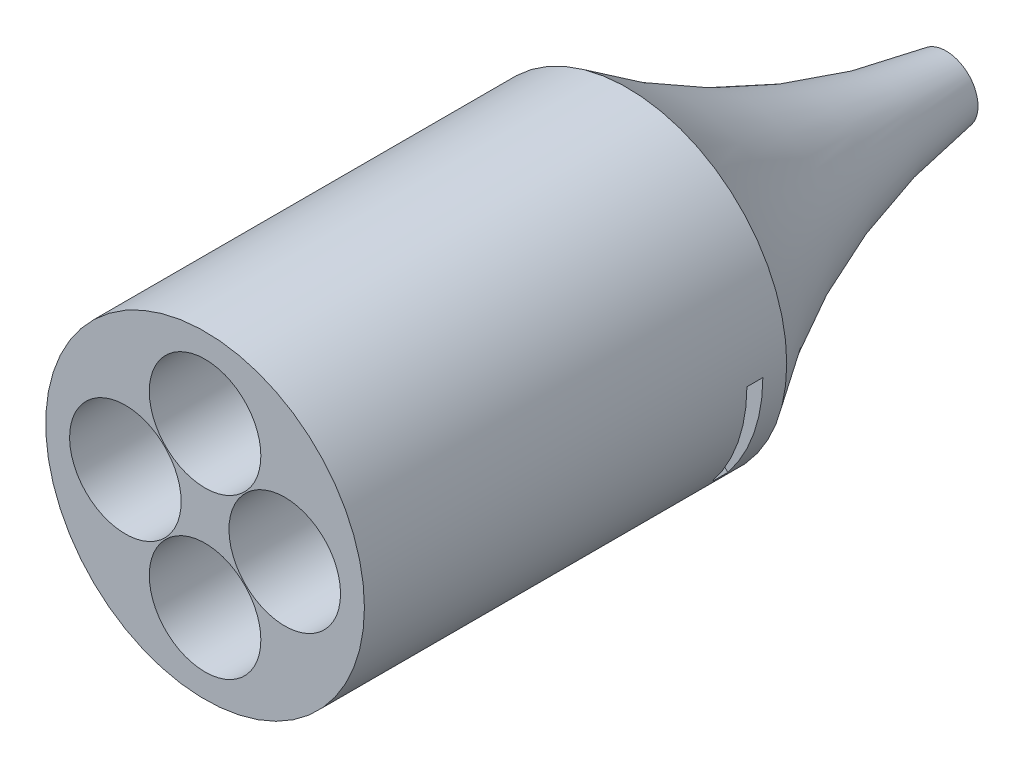
ISO-10303-21;
HEADER;
FILE_DESCRIPTION(('STEP AP214'),'2;1');
FILE_NAME('part.step','',(''),(''),'','','');
FILE_SCHEMA(('AUTOMOTIVE_DESIGN { 1 0 10303 214 1 1 1 1 }'));
ENDSEC;
DATA;
#1=APPLICATION_CONTEXT('core data for automotive mechanical design processes');
#2=APPLICATION_PROTOCOL_DEFINITION('international standard','automotive_design',2000,#1);
#3=PRODUCT_CONTEXT('',#1,'mechanical');
#4=PRODUCT('Part','Part','',(#3));
#5=PRODUCT_RELATED_PRODUCT_CATEGORY('part','',(#4));
#6=PRODUCT_DEFINITION_FORMATION('','',#4);
#7=PRODUCT_DEFINITION_CONTEXT('part definition',#1,'design');
#8=PRODUCT_DEFINITION('design','',#6,#7);
#9=PRODUCT_DEFINITION_SHAPE('','',#8);
#10=(LENGTH_UNIT() NAMED_UNIT(*) SI_UNIT(.MILLI.,.METRE.));
#11=(NAMED_UNIT(*) PLANE_ANGLE_UNIT() SI_UNIT($,.RADIAN.));
#12=(NAMED_UNIT(*) SI_UNIT($,.STERADIAN.) SOLID_ANGLE_UNIT());
#13=UNCERTAINTY_MEASURE_WITH_UNIT(LENGTH_MEASURE(1.E-05),#10,'distance_accuracy_value','');
#14=(GEOMETRIC_REPRESENTATION_CONTEXT(3) GLOBAL_UNCERTAINTY_ASSIGNED_CONTEXT((#13)) GLOBAL_UNIT_ASSIGNED_CONTEXT((#10,
#11,#12)) REPRESENTATION_CONTEXT('',''));
#15=CARTESIAN_POINT('',(0.,0.,0.));
#16=DIRECTION('',(0.,0.,1.));
#17=DIRECTION('',(1.,0.,0.));
#18=AXIS2_PLACEMENT_3D('',#15,#16,#17);
#19=CARTESIAN_POINT('',(-44.2113078895074,7.29731934731934,3.));
#20=DIRECTION('',(0.,0.,-1.));
#21=DIRECTION('',(-1.,0.,0.));
#22=AXIS2_PLACEMENT_3D('',#19,#20,#21);
#23=CYLINDRICAL_SURFACE('',#22,20.);
#24=DIRECTION('',(0.,0.,-1.));
#25=VECTOR('',#24,1.);
#26=CARTESIAN_POINT('',(-43.8114923962338,-12.6986839426218,3.));
#27=LINE('',#26,#25);
#28=CARTESIAN_POINT('',(-43.8114923962338,-12.6986839426218,3.));
#29=VERTEX_POINT('',#28);
#30=CARTESIAN_POINT('',(-43.8114923962338,-12.6986839426218,5.));
#31=VERTEX_POINT('',#30);
#32=EDGE_CURVE('E283',#29,#31,#27,.F.);
#33=ORIENTED_EDGE('',*,*,#32,.T.);
#34=CARTESIAN_POINT('',(-44.2113078895074,7.29731934731934,5.));
#35=DIRECTION('',(0.,0.,1.));
#36=DIRECTION('',(0.,-1.,0.));
#37=AXIS2_PLACEMENT_3D('',#34,#35,#36);
#38=CIRCLE('',#37,20.);
#39=CARTESIAN_POINT('',(-31.4001864633208,-8.06090866907309,5.));
#40=VERTEX_POINT('',#39);
#41=EDGE_CURVE('E156',#31,#40,#38,.T.);
#42=ORIENTED_EDGE('',*,*,#41,.T.);
#43=DIRECTION('',(0.,0.,-1.));
#44=VECTOR('',#43,1.);
#45=CARTESIAN_POINT('',(-31.4001864633208,-8.06090866907309,3.));
#46=LINE('',#45,#44);
#47=CARTESIAN_POINT('',(-31.4001864633208,-8.06090866907309,3.));
#48=VERTEX_POINT('',#47);
#49=EDGE_CURVE('E301',#40,#48,#46,.T.);
#50=ORIENTED_EDGE('',*,*,#49,.T.);
#51=CARTESIAN_POINT('',(-44.2113078895074,7.29731934731934,3.));
#52=DIRECTION('',(0.,0.,-1.));
#53=DIRECTION('',(0.,1.,0.));
#54=AXIS2_PLACEMENT_3D('',#51,#52,#53);
#55=CIRCLE('',#54,20.);
#56=EDGE_CURVE('E249',#48,#29,#55,.T.);
#57=ORIENTED_EDGE('',*,*,#56,.T.);
#58=EDGE_LOOP('',(#33,#42,#50,#57));
#59=FACE_BOUND('',#58,.T.);
#60=CARTESIAN_POINT('',(-44.2113078895074,7.29731934731934,5.00000000000001));
#61=DIRECTION('',(0.,0.,1.));
#62=DIRECTION('',(1.,0.,0.));
#63=AXIS2_PLACEMENT_3D('',#60,#61,#62);
#64=CIRCLE('',#63,20.);
#65=CARTESIAN_POINT('',(-28.6001601053386,-5.2043631338846,5.00000000000001));
#66=VERTEX_POINT('',#65);
#67=CARTESIAN_POINT('',(-24.2113078903588,7.29713480369754,5.00000000000001));
#68=VERTEX_POINT('',#67);
#69=EDGE_CURVE('E165',#66,#68,#64,.T.);
#70=ORIENTED_EDGE('',*,*,#69,.T.);
#71=DIRECTION('',(0.,0.,-1.));
#72=VECTOR('',#71,1.);
#73=CARTESIAN_POINT('',(-24.2113078903588,7.29713480369754,3.));
#74=LINE('',#73,#72);
#75=CARTESIAN_POINT('',(-24.2113078903588,7.29713480369754,3.));
#76=VERTEX_POINT('',#75);
#77=EDGE_CURVE('E247',#68,#76,#74,.T.);
#78=ORIENTED_EDGE('',*,*,#77,.T.);
#79=CARTESIAN_POINT('',(-44.2113078895074,7.29731934731934,3.));
#80=DIRECTION('',(0.,0.,-1.));
#81=DIRECTION('',(-1.,0.,0.));
#82=AXIS2_PLACEMENT_3D('',#79,#80,#81);
#83=CIRCLE('',#82,20.);
#84=CARTESIAN_POINT('',(-28.6001601053386,-5.2043631338846,3.));
#85=VERTEX_POINT('',#84);
#86=EDGE_CURVE('E172',#76,#85,#83,.T.);
#87=ORIENTED_EDGE('',*,*,#86,.T.);
#88=DIRECTION('',(0.,0.,-1.));
#89=VECTOR('',#88,1.);
#90=CARTESIAN_POINT('',(-28.6001601053386,-5.2043631338846,3.));
#91=LINE('',#90,#89);
#92=EDGE_CURVE('E238',#85,#66,#91,.F.);
#93=ORIENTED_EDGE('',*,*,#92,.T.);
#94=EDGE_LOOP('',(#70,#78,#87,#93));
#95=FACE_BOUND('',#94,.T.);
#96=CARTESIAN_POINT('',(-44.2113078895074,7.29731934731934,0.));
#97=DIRECTION('',(0.,0.,1.));
#98=DIRECTION('',(1.,0.,0.));
#99=AXIS2_PLACEMENT_3D('',#96,#97,#98);
#100=CIRCLE('',#99,20.);
#101=CARTESIAN_POINT('',(-24.2113078895074,7.29731934731934,0.));
#102=VERTEX_POINT('',#101);
#103=EDGE_CURVE('E183',#102,#102,#100,.T.);
#104=ORIENTED_EDGE('',*,*,#103,.T.);
#105=EDGE_LOOP('',(#104));
#106=FACE_BOUND('',#105,.T.);
#107=CARTESIAN_POINT('',(-44.2113078895074,7.29731934731934,53.));
#108=DIRECTION('',(0.,0.,1.));
#109=DIRECTION('',(1.,0.,0.));
#110=AXIS2_PLACEMENT_3D('',#107,#108,#109);
#111=CIRCLE('',#110,20.);
#112=CARTESIAN_POINT('',(-24.2113078895074,7.29731934731934,53.));
#113=VERTEX_POINT('',#112);
#114=EDGE_CURVE('E209',#113,#113,#111,.T.);
#115=ORIENTED_EDGE('',*,*,#114,.F.);
#116=EDGE_LOOP('',(#115));
#117=FACE_BOUND('',#116,.T.);
#118=ADVANCED_FACE('F33',(#59,#95,#106,#117),#23,.T.);
#119=CARTESIAN_POINT('',(-44.2113078895074,7.29731934731934,53.));
#120=DIRECTION('',(0.,0.,1.));
#121=DIRECTION('',(1.,0.,0.));
#122=AXIS2_PLACEMENT_3D('',#119,#120,#121);
#123=PLANE('',#122);
#124=CARTESIAN_POINT('',(-44.2113078895072,-2.70268065268067,53.));
#125=DIRECTION('',(0.,0.,1.));
#126=DIRECTION('',(1.,0.,0.));
#127=AXIS2_PLACEMENT_3D('',#124,#125,#126);
#128=CIRCLE('',#127,7.);
#129=CARTESIAN_POINT('',(-37.2113078895072,-2.70268065268067,53.));
#130=VERTEX_POINT('',#129);
#131=EDGE_CURVE('E193',#130,#130,#128,.T.);
#132=ORIENTED_EDGE('',*,*,#131,.F.);
#133=EDGE_LOOP('',(#132));
#134=FACE_BOUND('',#133,.T.);
#135=CARTESIAN_POINT('',(-44.2113078895074,17.2973193473193,53.));
#136=DIRECTION('',(0.,0.,1.));
#137=DIRECTION('',(1.,0.,0.));
#138=AXIS2_PLACEMENT_3D('',#135,#136,#137);
#139=CIRCLE('',#138,7.);
#140=CARTESIAN_POINT('',(-37.2113078895074,17.2973193473193,53.));
#141=VERTEX_POINT('',#140);
#142=EDGE_CURVE('E206',#141,#141,#139,.T.);
#143=ORIENTED_EDGE('',*,*,#142,.F.);
#144=EDGE_LOOP('',(#143));
#145=FACE_BOUND('',#144,.T.);
#146=ORIENTED_EDGE('',*,*,#114,.T.);
#147=EDGE_LOOP('',(#146));
#148=FACE_BOUND('',#147,.T.);
#149=CARTESIAN_POINT('',(-34.2113078895073,7.29731934731944,53.));
#150=DIRECTION('',(0.,0.,1.));
#151=DIRECTION('',(1.,0.,0.));
#152=AXIS2_PLACEMENT_3D('',#149,#150,#151);
#153=CIRCLE('',#152,7.);
#154=CARTESIAN_POINT('',(-27.2113078895073,7.29731934731944,53.));
#155=VERTEX_POINT('',#154);
#156=EDGE_CURVE('E200',#155,#155,#153,.T.);
#157=ORIENTED_EDGE('',*,*,#156,.F.);
#158=EDGE_LOOP('',(#157));
#159=FACE_BOUND('',#158,.T.);
#160=CARTESIAN_POINT('',(-54.2113078895073,7.2973193473193,53.));
#161=DIRECTION('',(0.,0.,1.));
#162=DIRECTION('',(1.,0.,0.));
#163=AXIS2_PLACEMENT_3D('',#160,#161,#162);
#164=CIRCLE('',#163,7.);
#165=CARTESIAN_POINT('',(-47.2113078895073,7.2973193473193,53.));
#166=VERTEX_POINT('',#165);
#167=EDGE_CURVE('E187',#166,#166,#164,.T.);
#168=ORIENTED_EDGE('',*,*,#167,.F.);
#169=EDGE_LOOP('',(#168));
#170=FACE_BOUND('',#169,.T.);
#171=ADVANCED_FACE('F489',(#134,#145,#148,#159,#170),#123,.T.);
#172=CARTESIAN_POINT('',(-44.2113078895074,17.2973193473193,53.));
#173=DIRECTION('',(0.,0.,-1.));
#174=DIRECTION('',(-1.,0.,0.));
#175=AXIS2_PLACEMENT_3D('',#172,#173,#174);
#176=CYLINDRICAL_SURFACE('',#175,7.);
#177=DIRECTION('',(0.,0.,-1.));
#178=VECTOR('',#177,1.);
#179=CARTESIAN_POINT('',(-38.4106534637318,21.2155342766882,53.));
#180=LINE('',#179,#178);
#181=CARTESIAN_POINT('',(-38.4106534637318,21.2155342766882,5.));
#182=VERTEX_POINT('',#181);
#183=CARTESIAN_POINT('',(-38.4106534637317,21.2155342766882,3.));
#184=VERTEX_POINT('',#183);
#185=EDGE_CURVE('E91',#182,#184,#180,.T.);
#186=ORIENTED_EDGE('',*,*,#185,.F.);
#187=CARTESIAN_POINT('',(-44.2113078895074,17.2973193473193,5.));
#188=DIRECTION('',(0.,0.,1.));
#189=DIRECTION('',(1.,0.,0.));
#190=AXIS2_PLACEMENT_3D('',#187,#188,#189);
#191=CIRCLE('',#190,7.);
#192=CARTESIAN_POINT('',(-44.41785713518,10.3003673388294,5.));
#193=VERTEX_POINT('',#192);
#194=EDGE_CURVE('E130',#193,#182,#191,.T.);
#195=ORIENTED_EDGE('',*,*,#194,.F.);
#196=DIRECTION('',(0.,0.,-1.));
#197=VECTOR('',#196,1.);
#198=CARTESIAN_POINT('',(-44.41785713518,10.3003673388294,53.));
#199=LINE('',#198,#197);
#200=CARTESIAN_POINT('',(-44.41785713518,10.3003673388294,3.));
#201=VERTEX_POINT('',#200);
#202=EDGE_CURVE('E141',#201,#193,#199,.F.);
#203=ORIENTED_EDGE('',*,*,#202,.F.);
#204=CARTESIAN_POINT('',(-44.2113078895074,17.2973193473193,3.));
#205=DIRECTION('',(0.,0.,1.));
#206=DIRECTION('',(1.,0.,0.));
#207=AXIS2_PLACEMENT_3D('',#204,#205,#206);
#208=CIRCLE('',#207,7.);
#209=CARTESIAN_POINT('',(-51.2027357749826,16.9510013977412,3.));
#210=VERTEX_POINT('',#209);
#211=EDGE_CURVE('E203',#210,#201,#208,.T.);
#212=ORIENTED_EDGE('',*,*,#211,.F.);
#213=DIRECTION('',(0.,0.,-1.));
#214=VECTOR('',#213,1.);
#215=CARTESIAN_POINT('',(-51.2027357749826,16.9510013977412,53.));
#216=LINE('',#215,#214);
#217=CARTESIAN_POINT('',(-51.2027357749826,16.9510013977412,5.));
#218=VERTEX_POINT('',#217);
#219=EDGE_CURVE('E149',#218,#210,#216,.T.);
#220=ORIENTED_EDGE('',*,*,#219,.F.);
#221=CARTESIAN_POINT('',(-51.2113077496476,17.2987186460666,5.00000000000001));
#222=VERTEX_POINT('',#221);
#223=EDGE_CURVE('E155',#222,#218,#191,.T.);
#224=ORIENTED_EDGE('',*,*,#223,.F.);
#225=DIRECTION('',(0.,0.,-1.));
#226=VECTOR('',#225,1.);
#227=CARTESIAN_POINT('',(-51.2113077496476,17.2987186460666,53.));
#228=LINE('',#227,#226);
#229=CARTESIAN_POINT('',(-51.2113077496476,17.2987186460666,3.));
#230=VERTEX_POINT('',#229);
#231=EDGE_CURVE('E306',#222,#230,#228,.T.);
#232=ORIENTED_EDGE('',*,*,#231,.T.);
#233=CARTESIAN_POINT('',(-44.3525777513682,24.2958936897215,3.));
#234=VERTEX_POINT('',#233);
#235=EDGE_CURVE('E213',#234,#230,#208,.T.);
#236=ORIENTED_EDGE('',*,*,#235,.F.);
#237=DIRECTION('',(0.,0.,-1.));
#238=VECTOR('',#237,1.);
#239=CARTESIAN_POINT('',(-44.3525777513682,24.2958936897215,53.));
#240=LINE('',#239,#238);
#241=CARTESIAN_POINT('',(-44.3525777513682,24.2958936897215,5.));
#242=VERTEX_POINT('',#241);
#243=EDGE_CURVE('E304',#234,#242,#240,.F.);
#244=ORIENTED_EDGE('',*,*,#243,.T.);
#245=CARTESIAN_POINT('',(-40.409781298538,23.1751076710133,5.));
#246=VERTEX_POINT('',#245);
#247=EDGE_CURVE('E158',#246,#242,#191,.T.);
#248=ORIENTED_EDGE('',*,*,#247,.F.);
#249=DIRECTION('',(0.,0.,-1.));
#250=VECTOR('',#249,1.);
#251=CARTESIAN_POINT('',(-40.409781298538,23.1751076710133,53.));
#252=LINE('',#251,#250);
#253=CARTESIAN_POINT('',(-40.409781298538,23.1751076710133,3.));
#254=VERTEX_POINT('',#253);
#255=EDGE_CURVE('E240',#254,#246,#252,.F.);
#256=ORIENTED_EDGE('',*,*,#255,.F.);
#257=EDGE_CURVE('E210',#184,#254,#208,.T.);
#258=ORIENTED_EDGE('',*,*,#257,.F.);
#259=EDGE_LOOP('',(#186,#195,#203,#212,#220,#224,#232,#236,#244,#248,#256,#258));
#260=FACE_BOUND('',#259,.T.);
#261=ORIENTED_EDGE('',*,*,#142,.T.);
#262=EDGE_LOOP('',(#261));
#263=FACE_BOUND('',#262,.T.);
#264=ADVANCED_FACE('F152',(#260,#263),#176,.F.);
#265=CARTESIAN_POINT('',(-34.2113078895073,7.29731934731944,53.));
#266=DIRECTION('',(0.,0.,-1.));
#267=DIRECTION('',(-1.,0.,0.));
#268=AXIS2_PLACEMENT_3D('',#265,#266,#267);
#269=CYLINDRICAL_SURFACE('',#268,7.);
#270=DIRECTION('',(0.,0.,-1.));
#271=VECTOR('',#270,1.);
#272=CARTESIAN_POINT('',(-29.3329984237615,12.3174883441178,53.));
#273=LINE('',#272,#271);
#274=CARTESIAN_POINT('',(-29.3329984237615,12.3174883441178,3.));
#275=VERTEX_POINT('',#274);
#276=CARTESIAN_POINT('',(-29.3329984237615,12.3174883441178,5.));
#277=VERTEX_POINT('',#276);
#278=EDGE_CURVE('E237',#275,#277,#273,.F.);
#279=ORIENTED_EDGE('',*,*,#278,.F.);
#280=CARTESIAN_POINT('',(-34.2113078895073,7.29731934731944,3.));
#281=DIRECTION('',(0.,0.,1.));
#282=DIRECTION('',(1.,0.,0.));
#283=AXIS2_PLACEMENT_3D('',#280,#281,#282);
#284=CIRCLE('',#283,7.);
#285=CARTESIAN_POINT('',(-29.2896173561217,12.2749656077103,3.));
#286=VERTEX_POINT('',#285);
#287=EDGE_CURVE('E36',#286,#275,#284,.T.);
#288=ORIENTED_EDGE('',*,*,#287,.F.);
#289=DIRECTION('',(0.,0.,-1.));
#290=VECTOR('',#289,1.);
#291=CARTESIAN_POINT('',(-29.2896173561217,12.2749656077103,53.));
#292=LINE('',#291,#290);
#293=CARTESIAN_POINT('',(-29.2896173561217,12.2749656077103,5.));
#294=VERTEX_POINT('',#293);
#295=EDGE_CURVE('E74',#294,#286,#292,.T.);
#296=ORIENTED_EDGE('',*,*,#295,.F.);
#297=CARTESIAN_POINT('',(-34.2113078895073,7.29731934731944,5.));
#298=DIRECTION('',(0.,0.,1.));
#299=DIRECTION('',(1.,0.,0.));
#300=AXIS2_PLACEMENT_3D('',#297,#298,#299);
#301=CIRCLE('',#300,7.);
#302=CARTESIAN_POINT('',(-34.2128954987706,0.297319527355383,5.));
#303=VERTEX_POINT('',#302);
#304=EDGE_CURVE('E42',#303,#294,#301,.T.);
#305=ORIENTED_EDGE('',*,*,#304,.F.);
#306=DIRECTION('',(0.,0.,-1.));
#307=VECTOR('',#306,1.);
#308=CARTESIAN_POINT('',(-34.2128954987706,0.297319527355381,53.));
#309=LINE('',#308,#307);
#310=CARTESIAN_POINT('',(-34.2128953151006,0.297319347319441,3.));
#311=VERTEX_POINT('',#310);
#312=EDGE_CURVE('E309',#311,#303,#309,.F.);
#313=ORIENTED_EDGE('',*,*,#312,.F.);
#314=CARTESIAN_POINT('',(-34.2113078895073,7.29731934731944,3.));
#315=DIRECTION('',(0.,0.,1.));
#316=DIRECTION('',(1.,0.,0.));
#317=AXIS2_PLACEMENT_3D('',#314,#315,#316);
#318=CIRCLE('',#317,7.);
#319=CARTESIAN_POINT('',(-41.2098784290054,7.15586121334179,3.));
#320=VERTEX_POINT('',#319);
#321=EDGE_CURVE('E196',#320,#311,#318,.T.);
#322=ORIENTED_EDGE('',*,*,#321,.F.);
#323=DIRECTION('',(0.,0.,-1.));
#324=VECTOR('',#323,1.);
#325=CARTESIAN_POINT('',(-41.2098784290054,7.15586121334179,53.));
#326=LINE('',#325,#324);
#327=CARTESIAN_POINT('',(-41.2098784290054,7.15586121334179,5.));
#328=VERTEX_POINT('',#327);
#329=EDGE_CURVE('E150',#328,#320,#326,.T.);
#330=ORIENTED_EDGE('',*,*,#329,.F.);
#331=EDGE_CURVE('E11',#277,#328,#301,.T.);
#332=ORIENTED_EDGE('',*,*,#331,.F.);
#333=EDGE_LOOP('',(#279,#288,#296,#305,#313,#322,#330,#332));
#334=FACE_BOUND('',#333,.T.);
#335=ORIENTED_EDGE('',*,*,#156,.T.);
#336=EDGE_LOOP('',(#335));
#337=FACE_BOUND('',#336,.T.);
#338=ADVANCED_FACE('F234',(#334,#337),#269,.F.);
#339=CARTESIAN_POINT('',(-44.2113078895072,-2.70268065268067,53.));
#340=DIRECTION('',(0.,0.,-1.));
#341=DIRECTION('',(-1.,0.,0.));
#342=AXIS2_PLACEMENT_3D('',#339,#340,#341);
#343=CYLINDRICAL_SURFACE('',#342,7.);
#344=DIRECTION('',(0.,0.,-1.));
#345=VECTOR('',#344,1.);
#346=CARTESIAN_POINT('',(-44.0047586438348,4.29427135580933,53.));
#347=LINE('',#346,#345);
#348=CARTESIAN_POINT('',(-44.0047586438348,4.29427135580933,3.));
#349=VERTEX_POINT('',#348);
#350=CARTESIAN_POINT('',(-44.0047586438348,4.29427135580933,5.));
#351=VERTEX_POINT('',#350);
#352=EDGE_CURVE('E295',#349,#351,#347,.F.);
#353=ORIENTED_EDGE('',*,*,#352,.F.);
#354=CARTESIAN_POINT('',(-44.2113078895072,-2.70268065268067,3.));
#355=DIRECTION('',(0.,0.,1.));
#356=DIRECTION('',(1.,0.,0.));
#357=AXIS2_PLACEMENT_3D('',#354,#355,#356);
#358=CIRCLE('',#357,7.);
#359=CARTESIAN_POINT('',(-37.219880004032,-2.35636270310281,3.));
#360=VERTEX_POINT('',#359);
#361=EDGE_CURVE('E197',#360,#349,#358,.T.);
#362=ORIENTED_EDGE('',*,*,#361,.F.);
#363=DIRECTION('',(0.,0.,-1.));
#364=VECTOR('',#363,1.);
#365=CARTESIAN_POINT('',(-37.219880004032,-2.35636270310281,53.));
#366=LINE('',#365,#364);
#367=CARTESIAN_POINT('',(-37.219880004032,-2.35636270310281,5.));
#368=VERTEX_POINT('',#367);
#369=EDGE_CURVE('E298',#368,#360,#366,.T.);
#370=ORIENTED_EDGE('',*,*,#369,.F.);
#371=CARTESIAN_POINT('',(-44.2113078895072,-2.70268065268067,5.));
#372=DIRECTION('',(0.,0.,1.));
#373=DIRECTION('',(0.,-1.,0.));
#374=AXIS2_PLACEMENT_3D('',#371,#372,#373);
#375=CIRCLE('',#374,7.);
#376=CARTESIAN_POINT('',(-48.0128344804772,-8.58046897637417,5.));
#377=VERTEX_POINT('',#376);
#378=EDGE_CURVE('E252',#377,#368,#375,.T.);
#379=ORIENTED_EDGE('',*,*,#378,.F.);
#380=DIRECTION('',(0.,0.,-1.));
#381=VECTOR('',#380,1.);
#382=CARTESIAN_POINT('',(-48.0128344804772,-8.58046897637416,53.));
#383=LINE('',#382,#381);
#384=CARTESIAN_POINT('',(-48.0128344804772,-8.58046897637416,3.));
#385=VERTEX_POINT('',#384);
#386=EDGE_CURVE('E284',#385,#377,#383,.F.);
#387=ORIENTED_EDGE('',*,*,#386,.F.);
#388=CARTESIAN_POINT('',(-50.0119623152824,-6.6208955820502,3.));
#389=VERTEX_POINT('',#388);
#390=EDGE_CURVE('E190',#389,#385,#358,.T.);
#391=ORIENTED_EDGE('',*,*,#390,.F.);
#392=DIRECTION('',(0.,0.,-1.));
#393=VECTOR('',#392,1.);
#394=CARTESIAN_POINT('',(-50.0119623152824,-6.6208955820502,53.));
#395=LINE('',#394,#393);
#396=CARTESIAN_POINT('',(-50.0119623152824,-6.6208955820502,5.));
#397=VERTEX_POINT('',#396);
#398=EDGE_CURVE('E277',#397,#389,#395,.T.);
#399=ORIENTED_EDGE('',*,*,#398,.F.);
#400=EDGE_CURVE('E161',#351,#397,#375,.T.);
#401=ORIENTED_EDGE('',*,*,#400,.F.);
#402=EDGE_LOOP('',(#353,#362,#370,#379,#387,#391,#399,#401));
#403=FACE_BOUND('',#402,.T.);
#404=ORIENTED_EDGE('',*,*,#131,.T.);
#405=EDGE_LOOP('',(#404));
#406=FACE_BOUND('',#405,.T.);
#407=ADVANCED_FACE('F278',(#403,#406),#343,.F.);
#408=CARTESIAN_POINT('',(-54.2113078895073,7.2973193473193,53.));
#409=DIRECTION('',(0.,0.,-1.));
#410=DIRECTION('',(-1.,0.,0.));
#411=AXIS2_PLACEMENT_3D('',#408,#409,#410);
#412=CYLINDRICAL_SURFACE('',#411,7.);
#413=DIRECTION('',(0.,0.,-1.));
#414=VECTOR('',#413,1.);
#415=CARTESIAN_POINT('',(-47.2127373500091,7.4387774812966,53.));
#416=LINE('',#415,#414);
#417=CARTESIAN_POINT('',(-47.2127373500091,7.4387774812966,5.));
#418=VERTEX_POINT('',#417);
#419=CARTESIAN_POINT('',(-47.2127373500091,7.4387774812966,3.));
#420=VERTEX_POINT('',#419);
#421=EDGE_CURVE('E287',#418,#420,#416,.T.);
#422=ORIENTED_EDGE('',*,*,#421,.F.);
#423=CARTESIAN_POINT('',(-54.2113078895073,7.2973193473193,5.));
#424=DIRECTION('',(0.,0.,1.));
#425=DIRECTION('',(0.,-1.,0.));
#426=AXIS2_PLACEMENT_3D('',#423,#424,#425);
#427=CIRCLE('',#426,7.);
#428=CARTESIAN_POINT('',(-59.0896173552943,2.2771503505611,5.));
#429=VERTEX_POINT('',#428);
#430=EDGE_CURVE('E222',#429,#418,#427,.T.);
#431=ORIENTED_EDGE('',*,*,#430,.F.);
#432=DIRECTION('',(0.,0.,-1.));
#433=VECTOR('',#432,1.);
#434=CARTESIAN_POINT('',(-59.0896173552943,2.2771503505611,53.));
#435=LINE('',#434,#433);
#436=CARTESIAN_POINT('',(-59.0896173552945,2.27715035056122,3.));
#437=VERTEX_POINT('',#436);
#438=EDGE_CURVE('E378',#437,#429,#435,.F.);
#439=ORIENTED_EDGE('',*,*,#438,.F.);
#440=CARTESIAN_POINT('',(-54.2113078895073,7.2973193473193,3.));
#441=DIRECTION('',(0.,0.,1.));
#442=DIRECTION('',(1.,0.,0.));
#443=AXIS2_PLACEMENT_3D('',#440,#441,#442);
#444=CIRCLE('',#443,7.);
#445=CARTESIAN_POINT('',(-59.1329984228518,2.31967308688785,3.));
#446=VERTEX_POINT('',#445);
#447=EDGE_CURVE('E219',#446,#437,#444,.T.);
#448=ORIENTED_EDGE('',*,*,#447,.F.);
#449=DIRECTION('',(0.,0.,-1.));
#450=VECTOR('',#449,1.);
#451=CARTESIAN_POINT('',(-59.1329984228519,2.31967308688797,53.));
#452=LINE('',#451,#450);
#453=CARTESIAN_POINT('',(-59.1329984228519,2.31967308688796,5.));
#454=VERTEX_POINT('',#453);
#455=EDGE_CURVE('E289',#454,#446,#452,.T.);
#456=ORIENTED_EDGE('',*,*,#455,.F.);
#457=CARTESIAN_POINT('',(-61.2085181503924,7.09971224986703,5.));
#458=VERTEX_POINT('',#457);
#459=EDGE_CURVE('E220',#458,#454,#427,.T.);
#460=ORIENTED_EDGE('',*,*,#459,.F.);
#461=DIRECTION('',(0.,0.,-1.));
#462=VECTOR('',#461,1.);
#463=CARTESIAN_POINT('',(-61.2085181503924,7.09971224986702,53.));
#464=LINE('',#463,#462);
#465=CARTESIAN_POINT('',(-61.2085181503924,7.09971224986703,3.));
#466=VERTEX_POINT('',#465);
#467=EDGE_CURVE('E373',#466,#458,#464,.F.);
#468=ORIENTED_EDGE('',*,*,#467,.F.);
#469=CARTESIAN_POINT('',(-54.2113078895073,7.2973193473193,3.));
#470=DIRECTION('',(0.,0.,1.));
#471=DIRECTION('',(1.,0.,0.));
#472=AXIS2_PLACEMENT_3D('',#469,#470,#471);
#473=CIRCLE('',#472,7.);
#474=EDGE_CURVE('E186',#420,#466,#473,.T.);
#475=ORIENTED_EDGE('',*,*,#474,.F.);
#476=EDGE_LOOP('',(#422,#431,#439,#448,#456,#460,#468,#475));
#477=FACE_BOUND('',#476,.T.);
#478=ORIENTED_EDGE('',*,*,#167,.T.);
#479=EDGE_LOOP('',(#478));
#480=FACE_BOUND('',#479,.T.);
#481=ADVANCED_FACE('F412',(#477,#480),#412,.F.);
#482=CARTESIAN_POINT('',(-44.2113078895074,7.29731934731934,3.));
#483=DIRECTION('',(0.,0.,1.));
#484=DIRECTION('',(1.,0.,0.));
#485=AXIS2_PLACEMENT_3D('',#482,#483,#484);
#486=PLANE('',#485);
#487=ORIENTED_EDGE('',*,*,#321,.T.);
#488=DIRECTION('',(0.714136383797121,-0.700006589495536,0.));
#489=VECTOR('',#488,1.);
#490=CARTESIAN_POINT('',(-51.3809313160818,17.12567118886,3.));
#491=LINE('',#490,#489);
#492=EDGE_CURVE('E333',#311,#85,#491,.T.);
#493=ORIENTED_EDGE('',*,*,#492,.T.);
#494=ORIENTED_EDGE('',*,*,#86,.F.);
#495=DIRECTION('',(0.714136383797121,-0.700006589495536,0.));
#496=VECTOR('',#495,1.);
#497=CARTESIAN_POINT('',(-42.9808522421354,25.6953077944255,3.));
#498=LINE('',#497,#496);
#499=EDGE_CURVE('E232',#286,#76,#498,.T.);
#500=ORIENTED_EDGE('',*,*,#499,.F.);
#501=ORIENTED_EDGE('',*,*,#287,.T.);
#502=EDGE_CURVE('E85',#184,#275,#498,.T.);
#503=ORIENTED_EDGE('',*,*,#502,.F.);
#504=ORIENTED_EDGE('',*,*,#257,.T.);
#505=CARTESIAN_POINT('',(-42.9808522421354,25.6953077944255,3.));
#506=VERTEX_POINT('',#505);
#507=EDGE_CURVE('E371',#506,#254,#498,.T.);
#508=ORIENTED_EDGE('',*,*,#507,.F.);
#509=DIRECTION('',(0.700006589495536,0.714136383797121,0.));
#510=VECTOR('',#509,1.);
#511=CARTESIAN_POINT('',(-51.3809313160818,17.12567118886,3.));
#512=LINE('',#511,#510);
#513=EDGE_CURVE('E339',#234,#506,#512,.T.);
#514=ORIENTED_EDGE('',*,*,#513,.F.);
#515=ORIENTED_EDGE('',*,*,#235,.T.);
#516=CARTESIAN_POINT('',(-51.3809313160818,17.12567118886,3.));
#517=VERTEX_POINT('',#516);
#518=EDGE_CURVE('E331',#517,#230,#512,.T.);
#519=ORIENTED_EDGE('',*,*,#518,.F.);
#520=EDGE_CURVE('E322',#517,#210,#491,.T.);
#521=ORIENTED_EDGE('',*,*,#520,.T.);
#522=ORIENTED_EDGE('',*,*,#211,.T.);
#523=EDGE_CURVE('E145',#201,#320,#491,.T.);
#524=ORIENTED_EDGE('',*,*,#523,.T.);
#525=EDGE_LOOP('',(#487,#493,#494,#500,#501,#503,#504,#508,#514,#515,#519,#521,#522,#524));
#526=FACE_BOUND('',#525,.T.);
#527=ADVANCED_FACE('F231',(#526),#486,.T.);
#528=ORIENTED_EDGE('',*,*,#447,.T.);
#529=DIRECTION('',(0.714136383797121,-0.700006589495536,0.));
#530=VECTOR('',#529,1.);
#531=CARTESIAN_POINT('',(-62.5810367480104,5.69948904810609,3.));
#532=LINE('',#531,#530);
#533=EDGE_CURVE('E407',#437,#389,#532,.T.);
#534=ORIENTED_EDGE('',*,*,#533,.T.);
#535=ORIENTED_EDGE('',*,*,#390,.T.);
#536=EDGE_CURVE('E409',#385,#29,#532,.T.);
#537=ORIENTED_EDGE('',*,*,#536,.T.);
#538=ORIENTED_EDGE('',*,*,#56,.F.);
#539=DIRECTION('',(0.714136383797121,-0.700006589495536,0.));
#540=VECTOR('',#539,1.);
#541=CARTESIAN_POINT('',(-54.180957674064,14.2691256536715,3.));
#542=LINE('',#541,#540);
#543=EDGE_CURVE('E406',#360,#48,#542,.T.);
#544=ORIENTED_EDGE('',*,*,#543,.F.);
#545=ORIENTED_EDGE('',*,*,#361,.T.);
#546=EDGE_CURVE('E438',#420,#349,#542,.T.);
#547=ORIENTED_EDGE('',*,*,#546,.F.);
#548=ORIENTED_EDGE('',*,*,#474,.T.);
#549=DIRECTION('',(0.700006589495536,0.714136383797121,0.));
#550=VECTOR('',#549,1.);
#551=CARTESIAN_POINT('',(-54.180957674064,14.2691256536715,3.));
#552=LINE('',#551,#550);
#553=CARTESIAN_POINT('',(-62.5810367480104,5.69948904810609,3.));
#554=VERTEX_POINT('',#553);
#555=EDGE_CURVE('E404',#554,#466,#552,.T.);
#556=ORIENTED_EDGE('',*,*,#555,.F.);
#557=EDGE_CURVE('E396',#554,#446,#532,.T.);
#558=ORIENTED_EDGE('',*,*,#557,.T.);
#559=EDGE_LOOP('',(#528,#534,#535,#537,#538,#544,#545,#547,#548,#556,#558));
#560=FACE_BOUND('',#559,.T.);
#561=ADVANCED_FACE('F403',(#560),#486,.T.);
#562=CARTESIAN_POINT('',(-44.2113078895074,7.29731934731934,0.));
#563=DIRECTION('',(0.,0.,1.));
#564=DIRECTION('',(1.,0.,0.));
#565=AXIS2_PLACEMENT_3D('',#562,#563,#564);
#566=CYLINDRICAL_SURFACE('',#565,4.);
#567=CARTESIAN_POINT('',(-44.2113078895074,7.29731934731934,-40.));
#568=DIRECTION('',(0.,0.,1.));
#569=DIRECTION('',(1.,0.,0.));
#570=AXIS2_PLACEMENT_3D('',#567,#568,#569);
#571=CIRCLE('',#570,4.);
#572=CARTESIAN_POINT('',(-40.2113078895074,7.29731934731934,-40.));
#573=VERTEX_POINT('',#572);
#574=EDGE_CURVE('E178',#573,#573,#571,.T.);
#575=ORIENTED_EDGE('',*,*,#574,.F.);
#576=EDGE_LOOP('',(#575));
#577=FACE_BOUND('',#576,.T.);
#578=CARTESIAN_POINT('',(-44.2113078895074,7.29731934731934,0.));
#579=DIRECTION('',(0.,0.,1.));
#580=DIRECTION('',(1.,0.,0.));
#581=AXIS2_PLACEMENT_3D('',#578,#579,#580);
#582=CIRCLE('',#581,4.);
#583=CARTESIAN_POINT('',(-40.2113078895074,7.29731934731934,0.));
#584=VERTEX_POINT('',#583);
#585=EDGE_CURVE('E216',#584,#584,#582,.T.);
#586=ORIENTED_EDGE('',*,*,#585,.T.);
#587=EDGE_LOOP('',(#586));
#588=FACE_BOUND('',#587,.T.);
#589=ADVANCED_FACE('F619',(#577,#588),#566,.F.);
#590=CARTESIAN_POINT('',(-44.2113078895074,7.29731934731934,-51.061968836416));
#591=DIRECTION('',(0.,0.,1.));
#592=DIRECTION('',(1.,0.,0.));
#593=AXIS2_PLACEMENT_3D('',#590,#591,#592);
#594=TOROIDAL_SURFACE('',#593,89.6549220910401,86.3662713850725);
#595=ORIENTED_EDGE('',*,*,#103,.F.);
#596=EDGE_LOOP('',(#595));
#597=FACE_BOUND('',#596,.T.);
#598=ORIENTED_EDGE('',*,*,#574,.T.);
#599=EDGE_LOOP('',(#598));
#600=FACE_BOUND('',#599,.T.);
#601=ADVANCED_FACE('F676',(#597,#600),#594,.F.);
#602=CARTESIAN_POINT('',(-44.2113078895074,7.29731934731934,0.));
#603=DIRECTION('',(0.,0.,1.));
#604=DIRECTION('',(1.,0.,0.));
#605=AXIS2_PLACEMENT_3D('',#602,#603,#604);
#606=PLANE('',#605);
#607=ORIENTED_EDGE('',*,*,#585,.F.);
#608=EDGE_LOOP('',(#607));
#609=FACE_BOUND('',#608,.T.);
#610=ADVANCED_FACE('F609',(#609),#606,.F.);
#611=CARTESIAN_POINT('',(-34.7649269797819,34.077073401279,0.));
#612=DIRECTION('',(-0.714136383797121,0.700006589495536,0.));
#613=DIRECTION('',(-0.700006589495536,-0.714136383797121,0.));
#614=AXIS2_PLACEMENT_3D('',#611,#612,#613);
#615=PLANE('',#614);
#616=ORIENTED_EDGE('',*,*,#467,.T.);
#617=DIRECTION('',(-0.700006589495536,-0.714136383797121,0.));
#618=VECTOR('',#617,1.);
#619=CARTESIAN_POINT('',(-54.180957674064,14.2691256536715,5.));
#620=LINE('',#619,#618);
#621=CARTESIAN_POINT('',(-62.5810367480104,5.69948904810609,5.));
#622=VERTEX_POINT('',#621);
#623=EDGE_CURVE('E499',#458,#622,#620,.T.);
#624=ORIENTED_EDGE('',*,*,#623,.T.);
#625=DIRECTION('',(0.,0.,-1.));
#626=VECTOR('',#625,1.);
#627=CARTESIAN_POINT('',(-62.5810367480104,5.69948904810609,3.));
#628=LINE('',#627,#626);
#629=EDGE_CURVE('E498',#622,#554,#628,.T.);
#630=ORIENTED_EDGE('',*,*,#629,.T.);
#631=ORIENTED_EDGE('',*,*,#555,.T.);
#632=EDGE_LOOP('',(#616,#624,#630,#631));
#633=FACE_BOUND('',#632,.T.);
#634=ADVANCED_FACE('F503',(#633),#615,.F.);
#635=CARTESIAN_POINT('',(-62.5810367480104,5.69948904810609,3.));
#636=DIRECTION('',(-0.700006589495536,-0.714136383797121,0.));
#637=DIRECTION('',(0.714136383797121,-0.700006589495536,0.));
#638=AXIS2_PLACEMENT_3D('',#635,#636,#637);
#639=PLANE('',#638);
#640=ORIENTED_EDGE('',*,*,#455,.T.);
#641=ORIENTED_EDGE('',*,*,#557,.F.);
#642=ORIENTED_EDGE('',*,*,#629,.F.);
#643=DIRECTION('',(0.714136383797121,-0.700006589495536,0.));
#644=VECTOR('',#643,1.);
#645=CARTESIAN_POINT('',(-62.5810367480104,5.69948904810609,5.));
#646=LINE('',#645,#644);
#647=EDGE_CURVE('E400',#622,#454,#646,.T.);
#648=ORIENTED_EDGE('',*,*,#647,.T.);
#649=EDGE_LOOP('',(#640,#641,#642,#648));
#650=FACE_BOUND('',#649,.T.);
#651=ADVANCED_FACE('F393',(#650),#639,.F.);
#652=CARTESIAN_POINT('',(-54.180957674064,14.2691256536715,5.));
#653=DIRECTION('',(0.,0.,1.));
#654=DIRECTION('',(0.,-1.,0.));
#655=AXIS2_PLACEMENT_3D('',#652,#653,#654);
#656=PLANE('',#655);
#657=ORIENTED_EDGE('',*,*,#459,.T.);
#658=ORIENTED_EDGE('',*,*,#647,.F.);
#659=ORIENTED_EDGE('',*,*,#623,.F.);
#660=EDGE_LOOP('',(#657,#658,#659));
#661=FACE_BOUND('',#660,.T.);
#662=ADVANCED_FACE('F506',(#661),#656,.F.);
#663=ORIENTED_EDGE('',*,*,#398,.T.);
#664=ORIENTED_EDGE('',*,*,#533,.F.);
#665=ORIENTED_EDGE('',*,*,#438,.T.);
#666=EDGE_CURVE('E268',#429,#397,#646,.T.);
#667=ORIENTED_EDGE('',*,*,#666,.T.);
#668=EDGE_LOOP('',(#663,#664,#665,#667));
#669=FACE_BOUND('',#668,.T.);
#670=ADVANCED_FACE('F414',(#669),#639,.F.);
#671=CARTESIAN_POINT('',(-54.180957674064,14.2691256536715,3.));
#672=DIRECTION('',(0.700006589495536,0.714136383797121,0.));
#673=DIRECTION('',(-0.714136383797121,0.700006589495536,0.));
#674=AXIS2_PLACEMENT_3D('',#671,#672,#673);
#675=PLANE('',#674);
#676=ORIENTED_EDGE('',*,*,#352,.T.);
#677=DIRECTION('',(0.714136383797121,-0.700006589495536,0.));
#678=VECTOR('',#677,1.);
#679=CARTESIAN_POINT('',(-54.180957674064,14.2691256536715,5.));
#680=LINE('',#679,#678);
#681=EDGE_CURVE('E272',#418,#351,#680,.T.);
#682=ORIENTED_EDGE('',*,*,#681,.F.);
#683=ORIENTED_EDGE('',*,*,#421,.T.);
#684=ORIENTED_EDGE('',*,*,#546,.T.);
#685=EDGE_LOOP('',(#676,#682,#683,#684));
#686=FACE_BOUND('',#685,.T.);
#687=ADVANCED_FACE('F436',(#686),#675,.F.);
#688=ORIENTED_EDGE('',*,*,#400,.T.);
#689=ORIENTED_EDGE('',*,*,#666,.F.);
#690=ORIENTED_EDGE('',*,*,#430,.T.);
#691=ORIENTED_EDGE('',*,*,#681,.T.);
#692=EDGE_LOOP('',(#688,#689,#690,#691));
#693=FACE_BOUND('',#692,.T.);
#694=ADVANCED_FACE('F265',(#693),#656,.F.);
#695=EDGE_CURVE('E51',#377,#31,#646,.T.);
#696=ORIENTED_EDGE('',*,*,#695,.F.);
#697=ORIENTED_EDGE('',*,*,#378,.T.);
#698=EDGE_CURVE('E447',#368,#40,#680,.T.);
#699=ORIENTED_EDGE('',*,*,#698,.T.);
#700=ORIENTED_EDGE('',*,*,#41,.F.);
#701=EDGE_LOOP('',(#696,#697,#699,#700));
#702=FACE_BOUND('',#701,.T.);
#703=ADVANCED_FACE('F497',(#702),#656,.F.);
#704=ORIENTED_EDGE('',*,*,#698,.F.);
#705=ORIENTED_EDGE('',*,*,#369,.T.);
#706=ORIENTED_EDGE('',*,*,#543,.T.);
#707=ORIENTED_EDGE('',*,*,#49,.F.);
#708=EDGE_LOOP('',(#704,#705,#706,#707));
#709=FACE_BOUND('',#708,.T.);
#710=ADVANCED_FACE('F496',(#709),#675,.F.);
#711=ORIENTED_EDGE('',*,*,#536,.F.);
#712=ORIENTED_EDGE('',*,*,#386,.T.);
#713=ORIENTED_EDGE('',*,*,#695,.T.);
#714=ORIENTED_EDGE('',*,*,#32,.F.);
#715=EDGE_LOOP('',(#711,#712,#713,#714));
#716=FACE_BOUND('',#715,.T.);
#717=ADVANCED_FACE('F486',(#716),#639,.F.);
#718=CARTESIAN_POINT('',(-51.3809313160818,17.12567118886,5.00000000000001));
#719=DIRECTION('',(0.,0.,1.));
#720=DIRECTION('',(1.,0.,0.));
#721=AXIS2_PLACEMENT_3D('',#718,#719,#720);
#722=PLANE('',#721);
#723=DIRECTION('',(0.714136383797121,-0.700006589495536,0.));
#724=VECTOR('',#723,1.);
#725=CARTESIAN_POINT('',(-51.3809313160818,17.12567118886,5.00000000000001));
#726=LINE('',#725,#724);
#727=EDGE_CURVE('E137',#303,#66,#726,.T.);
#728=ORIENTED_EDGE('',*,*,#727,.F.);
#729=ORIENTED_EDGE('',*,*,#304,.T.);
#730=DIRECTION('',(0.714136383797121,-0.700006589495536,0.));
#731=VECTOR('',#730,1.);
#732=CARTESIAN_POINT('',(-42.9808522421354,25.6953077944255,5.00000000000001));
#733=LINE('',#732,#731);
#734=EDGE_CURVE('E369',#294,#68,#733,.T.);
#735=ORIENTED_EDGE('',*,*,#734,.T.);
#736=ORIENTED_EDGE('',*,*,#69,.F.);
#737=EDGE_LOOP('',(#728,#729,#735,#736));
#738=FACE_BOUND('',#737,.T.);
#739=ADVANCED_FACE('F473',(#738),#722,.F.);
#740=CARTESIAN_POINT('',(-51.3809313160818,17.12567118886,3.));
#741=DIRECTION('',(-0.700006589495536,-0.714136383797121,0.));
#742=DIRECTION('',(0.714136383797121,-0.700006589495536,0.));
#743=AXIS2_PLACEMENT_3D('',#740,#741,#742);
#744=PLANE('',#743);
#745=ORIENTED_EDGE('',*,*,#492,.F.);
#746=ORIENTED_EDGE('',*,*,#312,.T.);
#747=ORIENTED_EDGE('',*,*,#727,.T.);
#748=ORIENTED_EDGE('',*,*,#92,.F.);
#749=EDGE_LOOP('',(#745,#746,#747,#748));
#750=FACE_BOUND('',#749,.T.);
#751=ADVANCED_FACE('F363',(#750),#744,.F.);
#752=CARTESIAN_POINT('',(-42.9808522421354,25.6953077944255,5.00000000000001));
#753=DIRECTION('',(0.700006589495536,0.714136383797121,0.));
#754=DIRECTION('',(-0.714136383797121,0.700006589495536,0.));
#755=AXIS2_PLACEMENT_3D('',#752,#753,#754);
#756=PLANE('',#755);
#757=ORIENTED_EDGE('',*,*,#734,.F.);
#758=ORIENTED_EDGE('',*,*,#295,.T.);
#759=ORIENTED_EDGE('',*,*,#499,.T.);
#760=ORIENTED_EDGE('',*,*,#77,.F.);
#761=EDGE_LOOP('',(#757,#758,#759,#760));
#762=FACE_BOUND('',#761,.T.);
#763=ADVANCED_FACE('F368',(#762),#756,.F.);
#764=ORIENTED_EDGE('',*,*,#194,.T.);
#765=EDGE_CURVE('E460',#182,#277,#733,.T.);
#766=ORIENTED_EDGE('',*,*,#765,.T.);
#767=ORIENTED_EDGE('',*,*,#331,.T.);
#768=EDGE_CURVE('E126',#193,#328,#726,.T.);
#769=ORIENTED_EDGE('',*,*,#768,.F.);
#770=EDGE_LOOP('',(#764,#766,#767,#769));
#771=FACE_BOUND('',#770,.T.);
#772=ADVANCED_FACE('F128',(#771),#722,.F.);
#773=ORIENTED_EDGE('',*,*,#202,.T.);
#774=ORIENTED_EDGE('',*,*,#768,.T.);
#775=ORIENTED_EDGE('',*,*,#329,.T.);
#776=ORIENTED_EDGE('',*,*,#523,.F.);
#777=EDGE_LOOP('',(#773,#774,#775,#776));
#778=FACE_BOUND('',#777,.T.);
#779=ADVANCED_FACE('F142',(#778),#744,.F.);
#780=ORIENTED_EDGE('',*,*,#185,.T.);
#781=ORIENTED_EDGE('',*,*,#502,.T.);
#782=ORIENTED_EDGE('',*,*,#278,.T.);
#783=ORIENTED_EDGE('',*,*,#765,.F.);
#784=EDGE_LOOP('',(#780,#781,#782,#783));
#785=FACE_BOUND('',#784,.T.);
#786=ADVANCED_FACE('F479',(#785),#756,.F.);
#787=CARTESIAN_POINT('',(-34.7649269797819,34.077073401279,0.));
#788=DIRECTION('',(0.714136383797121,-0.700006589495536,0.));
#789=DIRECTION('',(0.700006589495536,0.714136383797121,0.));
#790=AXIS2_PLACEMENT_3D('',#787,#788,#789);
#791=PLANE('',#790);
#792=ORIENTED_EDGE('',*,*,#513,.T.);
#793=DIRECTION('',(0.,0.,1.));
#794=VECTOR('',#793,1.);
#795=CARTESIAN_POINT('',(-42.9808522421354,25.6953077944255,5.00000000000001));
#796=LINE('',#795,#794);
#797=CARTESIAN_POINT('',(-42.9808522421354,25.6953077944255,5.00000000000001));
#798=VERTEX_POINT('',#797);
#799=EDGE_CURVE('E452',#506,#798,#796,.T.);
#800=ORIENTED_EDGE('',*,*,#799,.T.);
#801=DIRECTION('',(-0.700006589495536,-0.714136383797121,0.));
#802=VECTOR('',#801,1.);
#803=CARTESIAN_POINT('',(-51.3809313160818,17.12567118886,5.00000000000001));
#804=LINE('',#803,#802);
#805=EDGE_CURVE('E456',#798,#242,#804,.T.);
#806=ORIENTED_EDGE('',*,*,#805,.T.);
#807=ORIENTED_EDGE('',*,*,#243,.F.);
#808=EDGE_LOOP('',(#792,#800,#806,#807));
#809=FACE_BOUND('',#808,.T.);
#810=ADVANCED_FACE('F462',(#809),#791,.T.);
#811=ORIENTED_EDGE('',*,*,#247,.T.);
#812=ORIENTED_EDGE('',*,*,#805,.F.);
#813=EDGE_CURVE('E388',#798,#246,#733,.T.);
#814=ORIENTED_EDGE('',*,*,#813,.T.);
#815=EDGE_LOOP('',(#811,#812,#814));
#816=FACE_BOUND('',#815,.T.);
#817=ADVANCED_FACE('F469',(#816),#722,.F.);
#818=ORIENTED_EDGE('',*,*,#255,.T.);
#819=ORIENTED_EDGE('',*,*,#813,.F.);
#820=ORIENTED_EDGE('',*,*,#799,.F.);
#821=ORIENTED_EDGE('',*,*,#507,.T.);
#822=EDGE_LOOP('',(#818,#819,#820,#821));
#823=FACE_BOUND('',#822,.T.);
#824=ADVANCED_FACE('F466',(#823),#756,.F.);
#825=ORIENTED_EDGE('',*,*,#223,.T.);
#826=CARTESIAN_POINT('',(-51.3809313160818,17.12567118886,5.00000000000001));
#827=VERTEX_POINT('',#826);
#828=EDGE_CURVE('E136',#827,#218,#726,.T.);
#829=ORIENTED_EDGE('',*,*,#828,.F.);
#830=EDGE_CURVE('E455',#222,#827,#804,.T.);
#831=ORIENTED_EDGE('',*,*,#830,.F.);
#832=EDGE_LOOP('',(#825,#829,#831));
#833=FACE_BOUND('',#832,.T.);
#834=ADVANCED_FACE('F472',(#833),#722,.F.);
#835=ORIENTED_EDGE('',*,*,#219,.T.);
#836=ORIENTED_EDGE('',*,*,#520,.F.);
#837=DIRECTION('',(0.,0.,-1.));
#838=VECTOR('',#837,1.);
#839=CARTESIAN_POINT('',(-51.3809313160818,17.12567118886,3.));
#840=LINE('',#839,#838);
#841=EDGE_CURVE('E458',#827,#517,#840,.T.);
#842=ORIENTED_EDGE('',*,*,#841,.F.);
#843=ORIENTED_EDGE('',*,*,#828,.T.);
#844=EDGE_LOOP('',(#835,#836,#842,#843));
#845=FACE_BOUND('',#844,.T.);
#846=ADVANCED_FACE('F319',(#845),#744,.F.);
#847=ORIENTED_EDGE('',*,*,#830,.T.);
#848=ORIENTED_EDGE('',*,*,#841,.T.);
#849=ORIENTED_EDGE('',*,*,#518,.T.);
#850=ORIENTED_EDGE('',*,*,#231,.F.);
#851=EDGE_LOOP('',(#847,#848,#849,#850));
#852=FACE_BOUND('',#851,.T.);
#853=ADVANCED_FACE('F481',(#852),#791,.T.);
#854=CLOSED_SHELL('',(#118,#171,#264,#338,#407,#481,#527,#561,#589,#601,#610,#634,#651,#662,
#670,#687,#694,#703,#710,#717,#739,#751,#763,#772,#779,#786,#810,#817,#824,#834,#846,#853));
#855=MANIFOLD_SOLID_BREP('B2',#854);
#856=ADVANCED_BREP_SHAPE_REPRESENTATION('',(#18,#855),#14);
#857=SHAPE_DEFINITION_REPRESENTATION(#9,#856);
ENDSEC;
END-ISO-10303-21;
